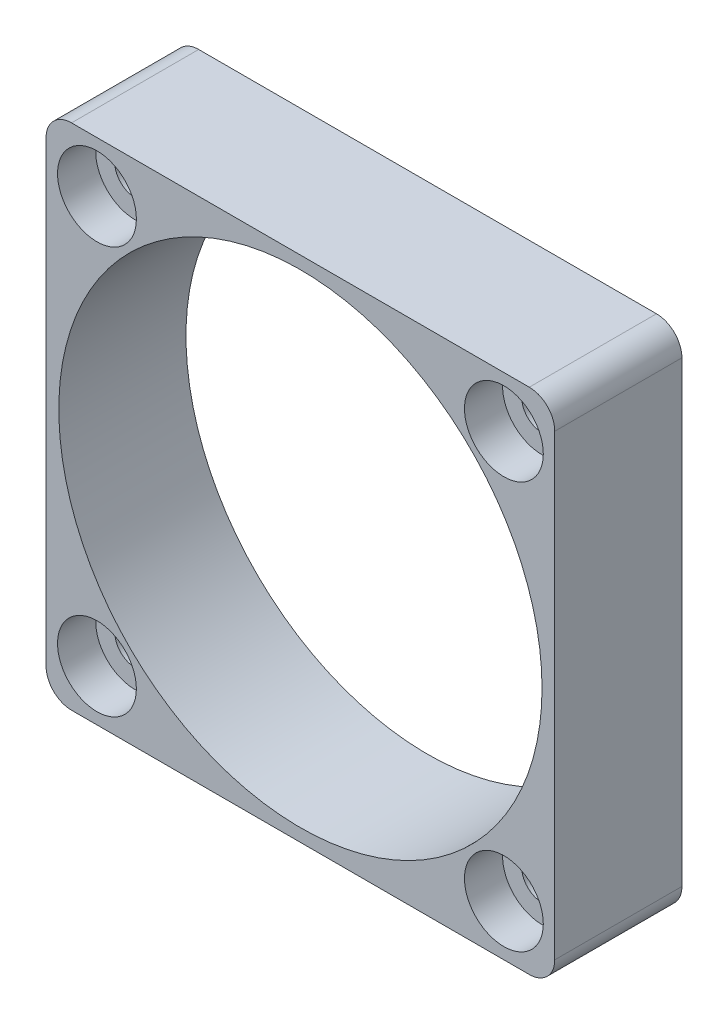
ISO-10303-21;
HEADER;
FILE_DESCRIPTION(('STEP AP214'),'2;1');
FILE_NAME('part.step','',(''),(''),'','','');
FILE_SCHEMA(('AUTOMOTIVE_DESIGN { 1 0 10303 214 1 1 1 1 }'));
ENDSEC;
DATA;
#1=APPLICATION_CONTEXT('core data for automotive mechanical design processes');
#2=APPLICATION_PROTOCOL_DEFINITION('international standard','automotive_design',2000,#1);
#3=PRODUCT_CONTEXT('',#1,'mechanical');
#4=PRODUCT('Part','Part','',(#3));
#5=PRODUCT_RELATED_PRODUCT_CATEGORY('part','',(#4));
#6=PRODUCT_DEFINITION_FORMATION('','',#4);
#7=PRODUCT_DEFINITION_CONTEXT('part definition',#1,'design');
#8=PRODUCT_DEFINITION('design','',#6,#7);
#9=PRODUCT_DEFINITION_SHAPE('','',#8);
#10=(LENGTH_UNIT() NAMED_UNIT(*) SI_UNIT(.MILLI.,.METRE.));
#11=(NAMED_UNIT(*) PLANE_ANGLE_UNIT() SI_UNIT($,.RADIAN.));
#12=(NAMED_UNIT(*) SI_UNIT($,.STERADIAN.) SOLID_ANGLE_UNIT());
#13=UNCERTAINTY_MEASURE_WITH_UNIT(LENGTH_MEASURE(1.E-05),#10,'distance_accuracy_value','');
#14=(GEOMETRIC_REPRESENTATION_CONTEXT(3) GLOBAL_UNCERTAINTY_ASSIGNED_CONTEXT((#13)) GLOBAL_UNIT_ASSIGNED_CONTEXT((#10,
#11,#12)) REPRESENTATION_CONTEXT('',''));
#15=CARTESIAN_POINT('',(0.,0.,0.));
#16=DIRECTION('',(0.,0.,1.));
#17=DIRECTION('',(1.,0.,0.));
#18=AXIS2_PLACEMENT_3D('',#15,#16,#17);
#19=CARTESIAN_POINT('',(-16.,16.,0.));
#20=DIRECTION('',(0.,0.,1.));
#21=DIRECTION('',(1.,0.,0.));
#22=AXIS2_PLACEMENT_3D('',#19,#20,#21);
#23=CYLINDRICAL_SURFACE('',#22,1.6);
#24=CARTESIAN_POINT('',(-16.,16.,0.));
#25=DIRECTION('',(0.,0.,1.));
#26=DIRECTION('',(1.,0.,0.));
#27=AXIS2_PLACEMENT_3D('',#24,#25,#26);
#28=CIRCLE('',#27,1.6);
#29=CARTESIAN_POINT('',(-14.4,16.,0.));
#30=VERTEX_POINT('',#29);
#31=EDGE_CURVE('E199',#30,#30,#28,.T.);
#32=ORIENTED_EDGE('',*,*,#31,.F.);
#33=EDGE_LOOP('',(#32));
#34=FACE_BOUND('',#33,.T.);
#35=CARTESIAN_POINT('',(-16.,16.,7.));
#36=DIRECTION('',(0.,0.,1.));
#37=DIRECTION('',(1.,0.,0.));
#38=AXIS2_PLACEMENT_3D('',#35,#36,#37);
#39=CIRCLE('',#38,1.6);
#40=CARTESIAN_POINT('',(-14.4,16.,7.));
#41=VERTEX_POINT('',#40);
#42=EDGE_CURVE('E37',#41,#41,#39,.F.);
#43=ORIENTED_EDGE('',*,*,#42,.F.);
#44=EDGE_LOOP('',(#43));
#45=FACE_BOUND('',#44,.T.);
#46=ADVANCED_FACE('F33',(#34,#45),#23,.F.);
#47=CARTESIAN_POINT('',(16.,16.,0.));
#48=DIRECTION('',(0.,0.,1.));
#49=DIRECTION('',(1.,0.,0.));
#50=AXIS2_PLACEMENT_3D('',#47,#48,#49);
#51=CYLINDRICAL_SURFACE('',#50,1.6);
#52=CARTESIAN_POINT('',(16.,16.,0.));
#53=DIRECTION('',(0.,0.,1.));
#54=DIRECTION('',(1.,0.,0.));
#55=AXIS2_PLACEMENT_3D('',#52,#53,#54);
#56=CIRCLE('',#55,1.6);
#57=CARTESIAN_POINT('',(17.6,16.,0.));
#58=VERTEX_POINT('',#57);
#59=EDGE_CURVE('E196',#58,#58,#56,.T.);
#60=ORIENTED_EDGE('',*,*,#59,.F.);
#61=EDGE_LOOP('',(#60));
#62=FACE_BOUND('',#61,.T.);
#63=CARTESIAN_POINT('',(16.,16.,7.));
#64=DIRECTION('',(0.,0.,1.));
#65=DIRECTION('',(1.,0.,0.));
#66=AXIS2_PLACEMENT_3D('',#63,#64,#65);
#67=CIRCLE('',#66,1.6);
#68=CARTESIAN_POINT('',(17.6,16.,7.));
#69=VERTEX_POINT('',#68);
#70=EDGE_CURVE('E166',#69,#69,#67,.F.);
#71=ORIENTED_EDGE('',*,*,#70,.F.);
#72=EDGE_LOOP('',(#71));
#73=FACE_BOUND('',#72,.T.);
#74=ADVANCED_FACE('F236',(#62,#73),#51,.F.);
#75=CARTESIAN_POINT('',(16.,-16.,0.));
#76=DIRECTION('',(0.,0.,1.));
#77=DIRECTION('',(1.,0.,0.));
#78=AXIS2_PLACEMENT_3D('',#75,#76,#77);
#79=CYLINDRICAL_SURFACE('',#78,1.6);
#80=CARTESIAN_POINT('',(16.,-16.,0.));
#81=DIRECTION('',(0.,0.,1.));
#82=DIRECTION('',(1.,0.,0.));
#83=AXIS2_PLACEMENT_3D('',#80,#81,#82);
#84=CIRCLE('',#83,1.6);
#85=CARTESIAN_POINT('',(17.6,-16.,0.));
#86=VERTEX_POINT('',#85);
#87=EDGE_CURVE('E193',#86,#86,#84,.T.);
#88=ORIENTED_EDGE('',*,*,#87,.F.);
#89=EDGE_LOOP('',(#88));
#90=FACE_BOUND('',#89,.T.);
#91=CARTESIAN_POINT('',(16.,-16.,7.));
#92=DIRECTION('',(0.,0.,1.));
#93=DIRECTION('',(1.,0.,0.));
#94=AXIS2_PLACEMENT_3D('',#91,#92,#93);
#95=CIRCLE('',#94,1.6);
#96=CARTESIAN_POINT('',(17.6,-16.,7.));
#97=VERTEX_POINT('',#96);
#98=EDGE_CURVE('E162',#97,#97,#95,.F.);
#99=ORIENTED_EDGE('',*,*,#98,.F.);
#100=EDGE_LOOP('',(#99));
#101=FACE_BOUND('',#100,.T.);
#102=ADVANCED_FACE('F242',(#90,#101),#79,.F.);
#103=CARTESIAN_POINT('',(-16.,-16.,0.));
#104=DIRECTION('',(0.,0.,1.));
#105=DIRECTION('',(1.,0.,0.));
#106=AXIS2_PLACEMENT_3D('',#103,#104,#105);
#107=CYLINDRICAL_SURFACE('',#106,1.6);
#108=CARTESIAN_POINT('',(-16.,-16.,0.));
#109=DIRECTION('',(0.,0.,1.));
#110=DIRECTION('',(1.,0.,0.));
#111=AXIS2_PLACEMENT_3D('',#108,#109,#110);
#112=CIRCLE('',#111,1.6);
#113=CARTESIAN_POINT('',(-14.4,-16.,0.));
#114=VERTEX_POINT('',#113);
#115=EDGE_CURVE('E160',#114,#114,#112,.T.);
#116=ORIENTED_EDGE('',*,*,#115,.F.);
#117=EDGE_LOOP('',(#116));
#118=FACE_BOUND('',#117,.T.);
#119=CARTESIAN_POINT('',(-16.,-16.,7.));
#120=DIRECTION('',(0.,0.,1.));
#121=DIRECTION('',(1.,0.,0.));
#122=AXIS2_PLACEMENT_3D('',#119,#120,#121);
#123=CIRCLE('',#122,1.6);
#124=CARTESIAN_POINT('',(-14.4,-16.,7.));
#125=VERTEX_POINT('',#124);
#126=EDGE_CURVE('E157',#125,#125,#123,.F.);
#127=ORIENTED_EDGE('',*,*,#126,.F.);
#128=EDGE_LOOP('',(#127));
#129=FACE_BOUND('',#128,.T.);
#130=ADVANCED_FACE('F275',(#118,#129),#107,.F.);
#131=CARTESIAN_POINT('',(20.,20.,10.));
#132=DIRECTION('',(-1.,0.,0.));
#133=DIRECTION('',(0.,0.,1.));
#134=AXIS2_PLACEMENT_3D('',#131,#132,#133);
#135=PLANE('',#134);
#136=DIRECTION('',(0.,1.,0.));
#137=VECTOR('',#136,1.);
#138=CARTESIAN_POINT('',(20.,20.,10.));
#139=LINE('',#138,#137);
#140=CARTESIAN_POINT('',(20.,-18.,10.));
#141=VERTEX_POINT('',#140);
#142=CARTESIAN_POINT('',(20.,18.,10.));
#143=VERTEX_POINT('',#142);
#144=EDGE_CURVE('E129',#141,#143,#139,.T.);
#145=ORIENTED_EDGE('',*,*,#144,.F.);
#146=DIRECTION('',(0.,0.,-1.));
#147=VECTOR('',#146,1.);
#148=CARTESIAN_POINT('',(20.,-18.,10.));
#149=LINE('',#148,#147);
#150=CARTESIAN_POINT('',(20.,-18.,0.));
#151=VERTEX_POINT('',#150);
#152=EDGE_CURVE('E11',#141,#151,#149,.T.);
#153=ORIENTED_EDGE('',*,*,#152,.T.);
#154=DIRECTION('',(0.,1.,0.));
#155=VECTOR('',#154,1.);
#156=CARTESIAN_POINT('',(20.,20.,0.));
#157=LINE('',#156,#155);
#158=CARTESIAN_POINT('',(20.,18.,0.));
#159=VERTEX_POINT('',#158);
#160=EDGE_CURVE('E206',#151,#159,#157,.T.);
#161=ORIENTED_EDGE('',*,*,#160,.T.);
#162=DIRECTION('',(0.,0.,-1.));
#163=VECTOR('',#162,1.);
#164=CARTESIAN_POINT('',(20.,18.,10.));
#165=LINE('',#164,#163);
#166=EDGE_CURVE('E42',#159,#143,#165,.F.);
#167=ORIENTED_EDGE('',*,*,#166,.T.);
#168=EDGE_LOOP('',(#145,#153,#161,#167));
#169=FACE_BOUND('',#168,.T.);
#170=ADVANCED_FACE('F233',(#169),#135,.F.);
#171=CARTESIAN_POINT('',(-20.,20.,10.));
#172=DIRECTION('',(0.,-1.,0.));
#173=DIRECTION('',(0.,0.,-1.));
#174=AXIS2_PLACEMENT_3D('',#171,#172,#173);
#175=PLANE('',#174);
#176=DIRECTION('',(-1.,0.,0.));
#177=VECTOR('',#176,1.);
#178=CARTESIAN_POINT('',(-20.,20.,0.));
#179=LINE('',#178,#177);
#180=CARTESIAN_POINT('',(18.,20.,0.));
#181=VERTEX_POINT('',#180);
#182=CARTESIAN_POINT('',(-18.,20.,0.));
#183=VERTEX_POINT('',#182);
#184=EDGE_CURVE('E134',#181,#183,#179,.T.);
#185=ORIENTED_EDGE('',*,*,#184,.T.);
#186=DIRECTION('',(0.,0.,-1.));
#187=VECTOR('',#186,1.);
#188=CARTESIAN_POINT('',(-18.,20.,10.));
#189=LINE('',#188,#187);
#190=CARTESIAN_POINT('',(-18.,20.,10.));
#191=VERTEX_POINT('',#190);
#192=EDGE_CURVE('E50',#183,#191,#189,.F.);
#193=ORIENTED_EDGE('',*,*,#192,.T.);
#194=DIRECTION('',(-1.,0.,0.));
#195=VECTOR('',#194,1.);
#196=CARTESIAN_POINT('',(-20.,20.,10.));
#197=LINE('',#196,#195);
#198=CARTESIAN_POINT('',(18.,20.,10.));
#199=VERTEX_POINT('',#198);
#200=EDGE_CURVE('E132',#199,#191,#197,.T.);
#201=ORIENTED_EDGE('',*,*,#200,.F.);
#202=DIRECTION('',(0.,0.,-1.));
#203=VECTOR('',#202,1.);
#204=CARTESIAN_POINT('',(18.,20.,10.));
#205=LINE('',#204,#203);
#206=EDGE_CURVE('E152',#199,#181,#205,.T.);
#207=ORIENTED_EDGE('',*,*,#206,.T.);
#208=EDGE_LOOP('',(#185,#193,#201,#207));
#209=FACE_BOUND('',#208,.T.);
#210=ADVANCED_FACE('F216',(#209),#175,.F.);
#211=CARTESIAN_POINT('',(-20.,20.,10.));
#212=DIRECTION('',(1.,0.,0.));
#213=DIRECTION('',(0.,1.,0.));
#214=AXIS2_PLACEMENT_3D('',#211,#212,#213);
#215=PLANE('',#214);
#216=DIRECTION('',(0.,-1.,0.));
#217=VECTOR('',#216,1.);
#218=CARTESIAN_POINT('',(-20.,20.,0.));
#219=LINE('',#218,#217);
#220=CARTESIAN_POINT('',(-20.,18.,0.));
#221=VERTEX_POINT('',#220);
#222=CARTESIAN_POINT('',(-20.,-18.,0.));
#223=VERTEX_POINT('',#222);
#224=EDGE_CURVE('E130',#221,#223,#219,.T.);
#225=ORIENTED_EDGE('',*,*,#224,.T.);
#226=DIRECTION('',(0.,0.,-1.));
#227=VECTOR('',#226,1.);
#228=CARTESIAN_POINT('',(-20.,-18.,10.));
#229=LINE('',#228,#227);
#230=CARTESIAN_POINT('',(-20.,-18.,10.));
#231=VERTEX_POINT('',#230);
#232=EDGE_CURVE('E107',#223,#231,#229,.F.);
#233=ORIENTED_EDGE('',*,*,#232,.T.);
#234=DIRECTION('',(0.,-1.,0.));
#235=VECTOR('',#234,1.);
#236=CARTESIAN_POINT('',(-20.,20.,10.));
#237=LINE('',#236,#235);
#238=CARTESIAN_POINT('',(-20.,18.,10.));
#239=VERTEX_POINT('',#238);
#240=EDGE_CURVE('E210',#239,#231,#237,.T.);
#241=ORIENTED_EDGE('',*,*,#240,.F.);
#242=DIRECTION('',(0.,0.,-1.));
#243=VECTOR('',#242,1.);
#244=CARTESIAN_POINT('',(-20.,18.,10.));
#245=LINE('',#244,#243);
#246=EDGE_CURVE('E112',#239,#221,#245,.T.);
#247=ORIENTED_EDGE('',*,*,#246,.T.);
#248=EDGE_LOOP('',(#225,#233,#241,#247));
#249=FACE_BOUND('',#248,.T.);
#250=ADVANCED_FACE('F225',(#249),#215,.F.);
#251=CARTESIAN_POINT('',(-20.,-20.,10.));
#252=DIRECTION('',(0.,1.,0.));
#253=DIRECTION('',(0.,0.,1.));
#254=AXIS2_PLACEMENT_3D('',#251,#252,#253);
#255=PLANE('',#254);
#256=DIRECTION('',(1.,0.,0.));
#257=VECTOR('',#256,1.);
#258=CARTESIAN_POINT('',(-20.,-20.,10.));
#259=LINE('',#258,#257);
#260=CARTESIAN_POINT('',(-18.,-20.,10.));
#261=VERTEX_POINT('',#260);
#262=CARTESIAN_POINT('',(18.,-20.,10.));
#263=VERTEX_POINT('',#262);
#264=EDGE_CURVE('E122',#261,#263,#259,.T.);
#265=ORIENTED_EDGE('',*,*,#264,.F.);
#266=DIRECTION('',(0.,0.,-1.));
#267=VECTOR('',#266,1.);
#268=CARTESIAN_POINT('',(-18.,-20.,10.));
#269=LINE('',#268,#267);
#270=CARTESIAN_POINT('',(-18.,-20.,0.));
#271=VERTEX_POINT('',#270);
#272=EDGE_CURVE('E106',#261,#271,#269,.T.);
#273=ORIENTED_EDGE('',*,*,#272,.T.);
#274=DIRECTION('',(1.,0.,0.));
#275=VECTOR('',#274,1.);
#276=CARTESIAN_POINT('',(-20.,-20.,0.));
#277=LINE('',#276,#275);
#278=CARTESIAN_POINT('',(18.,-20.,0.));
#279=VERTEX_POINT('',#278);
#280=EDGE_CURVE('E119',#271,#279,#277,.T.);
#281=ORIENTED_EDGE('',*,*,#280,.T.);
#282=DIRECTION('',(0.,0.,-1.));
#283=VECTOR('',#282,1.);
#284=CARTESIAN_POINT('',(18.,-20.,10.));
#285=LINE('',#284,#283);
#286=EDGE_CURVE('E124',#279,#263,#285,.F.);
#287=ORIENTED_EDGE('',*,*,#286,.T.);
#288=EDGE_LOOP('',(#265,#273,#281,#287));
#289=FACE_BOUND('',#288,.T.);
#290=ADVANCED_FACE('F118',(#289),#255,.F.);
#291=CARTESIAN_POINT('',(0.,0.,10.));
#292=DIRECTION('',(0.,0.,1.));
#293=DIRECTION('',(1.,0.,0.));
#294=AXIS2_PLACEMENT_3D('',#291,#292,#293);
#295=PLANE('',#294);
#296=CARTESIAN_POINT('',(-16.,16.,10.));
#297=DIRECTION('',(0.,0.,1.));
#298=DIRECTION('',(1.,0.,0.));
#299=AXIS2_PLACEMENT_3D('',#296,#297,#298);
#300=CIRCLE('',#299,3.1);
#301=CARTESIAN_POINT('',(-12.9,16.,10.));
#302=VERTEX_POINT('',#301);
#303=EDGE_CURVE('E182',#302,#302,#300,.T.);
#304=ORIENTED_EDGE('',*,*,#303,.F.);
#305=EDGE_LOOP('',(#304));
#306=FACE_BOUND('',#305,.T.);
#307=CARTESIAN_POINT('',(16.,16.,10.));
#308=DIRECTION('',(0.,0.,1.));
#309=DIRECTION('',(1.,0.,0.));
#310=AXIS2_PLACEMENT_3D('',#307,#308,#309);
#311=CIRCLE('',#310,3.1);
#312=CARTESIAN_POINT('',(19.1,16.,10.));
#313=VERTEX_POINT('',#312);
#314=EDGE_CURVE('E175',#313,#313,#311,.T.);
#315=ORIENTED_EDGE('',*,*,#314,.F.);
#316=EDGE_LOOP('',(#315));
#317=FACE_BOUND('',#316,.T.);
#318=CARTESIAN_POINT('',(16.,-16.,10.));
#319=DIRECTION('',(0.,0.,1.));
#320=DIRECTION('',(1.,0.,0.));
#321=AXIS2_PLACEMENT_3D('',#318,#319,#320);
#322=CIRCLE('',#321,3.1);
#323=CARTESIAN_POINT('',(19.1,-16.,10.));
#324=VERTEX_POINT('',#323);
#325=EDGE_CURVE('E168',#324,#324,#322,.T.);
#326=ORIENTED_EDGE('',*,*,#325,.F.);
#327=EDGE_LOOP('',(#326));
#328=FACE_BOUND('',#327,.T.);
#329=CARTESIAN_POINT('',(-16.,-16.,10.));
#330=DIRECTION('',(0.,0.,1.));
#331=DIRECTION('',(1.,0.,0.));
#332=AXIS2_PLACEMENT_3D('',#329,#330,#331);
#333=CIRCLE('',#332,3.1);
#334=CARTESIAN_POINT('',(-12.9,-16.,10.));
#335=VERTEX_POINT('',#334);
#336=EDGE_CURVE('E164',#335,#335,#333,.T.);
#337=ORIENTED_EDGE('',*,*,#336,.F.);
#338=EDGE_LOOP('',(#337));
#339=FACE_BOUND('',#338,.T.);
#340=CARTESIAN_POINT('',(0.,0.,10.));
#341=DIRECTION('',(0.,0.,1.));
#342=DIRECTION('',(1.,0.,0.));
#343=AXIS2_PLACEMENT_3D('',#340,#341,#342);
#344=CIRCLE('',#343,19.);
#345=CARTESIAN_POINT('',(19.,0.,10.));
#346=VERTEX_POINT('',#345);
#347=EDGE_CURVE('E202',#346,#346,#344,.T.);
#348=ORIENTED_EDGE('',*,*,#347,.F.);
#349=EDGE_LOOP('',(#348));
#350=FACE_BOUND('',#349,.T.);
#351=ORIENTED_EDGE('',*,*,#240,.T.);
#352=CARTESIAN_POINT('',(-18.,-18.,10.));
#353=DIRECTION('',(0.,0.,1.));
#354=DIRECTION('',(1.,0.,0.));
#355=AXIS2_PLACEMENT_3D('',#352,#353,#354);
#356=CIRCLE('',#355,2.);
#357=EDGE_CURVE('E150',#231,#261,#356,.T.);
#358=ORIENTED_EDGE('',*,*,#357,.T.);
#359=ORIENTED_EDGE('',*,*,#264,.T.);
#360=CARTESIAN_POINT('',(18.,-18.,10.));
#361=DIRECTION('',(0.,0.,1.));
#362=DIRECTION('',(1.,0.,0.));
#363=AXIS2_PLACEMENT_3D('',#360,#361,#362);
#364=CIRCLE('',#363,2.);
#365=EDGE_CURVE('E146',#263,#141,#364,.T.);
#366=ORIENTED_EDGE('',*,*,#365,.T.);
#367=ORIENTED_EDGE('',*,*,#144,.T.);
#368=CARTESIAN_POINT('',(18.,18.,10.));
#369=DIRECTION('',(0.,0.,1.));
#370=DIRECTION('',(1.,0.,0.));
#371=AXIS2_PLACEMENT_3D('',#368,#369,#370);
#372=CIRCLE('',#371,2.);
#373=EDGE_CURVE('E57',#143,#199,#372,.T.);
#374=ORIENTED_EDGE('',*,*,#373,.T.);
#375=ORIENTED_EDGE('',*,*,#200,.T.);
#376=CARTESIAN_POINT('',(-18.,18.,10.));
#377=DIRECTION('',(0.,0.,1.));
#378=DIRECTION('',(1.,0.,0.));
#379=AXIS2_PLACEMENT_3D('',#376,#377,#378);
#380=CIRCLE('',#379,2.);
#381=EDGE_CURVE('E148',#191,#239,#380,.T.);
#382=ORIENTED_EDGE('',*,*,#381,.T.);
#383=EDGE_LOOP('',(#351,#358,#359,#366,#367,#374,#375,#382));
#384=FACE_BOUND('',#383,.T.);
#385=ADVANCED_FACE('F223',(#306,#317,#328,#339,#350,#384),#295,.T.);
#386=CARTESIAN_POINT('',(0.,0.,0.));
#387=DIRECTION('',(0.,0.,1.));
#388=DIRECTION('',(1.,0.,0.));
#389=AXIS2_PLACEMENT_3D('',#386,#387,#388);
#390=PLANE('',#389);
#391=ORIENTED_EDGE('',*,*,#115,.T.);
#392=EDGE_LOOP('',(#391));
#393=FACE_BOUND('',#392,.T.);
#394=ORIENTED_EDGE('',*,*,#87,.T.);
#395=EDGE_LOOP('',(#394));
#396=FACE_BOUND('',#395,.T.);
#397=ORIENTED_EDGE('',*,*,#59,.T.);
#398=EDGE_LOOP('',(#397));
#399=FACE_BOUND('',#398,.T.);
#400=ORIENTED_EDGE('',*,*,#31,.T.);
#401=EDGE_LOOP('',(#400));
#402=FACE_BOUND('',#401,.T.);
#403=CARTESIAN_POINT('',(0.,0.,0.));
#404=DIRECTION('',(0.,0.,1.));
#405=DIRECTION('',(1.,0.,0.));
#406=AXIS2_PLACEMENT_3D('',#403,#404,#405);
#407=CIRCLE('',#406,19.);
#408=CARTESIAN_POINT('',(19.,0.,0.));
#409=VERTEX_POINT('',#408);
#410=EDGE_CURVE('E203',#409,#409,#407,.T.);
#411=ORIENTED_EDGE('',*,*,#410,.T.);
#412=EDGE_LOOP('',(#411));
#413=FACE_BOUND('',#412,.T.);
#414=ORIENTED_EDGE('',*,*,#280,.F.);
#415=CARTESIAN_POINT('',(-18.,-18.,0.));
#416=DIRECTION('',(0.,0.,1.));
#417=DIRECTION('',(1.,0.,0.));
#418=AXIS2_PLACEMENT_3D('',#415,#416,#417);
#419=CIRCLE('',#418,2.);
#420=EDGE_CURVE('E102',#271,#223,#419,.F.);
#421=ORIENTED_EDGE('',*,*,#420,.T.);
#422=ORIENTED_EDGE('',*,*,#224,.F.);
#423=CARTESIAN_POINT('',(-18.,18.,0.));
#424=DIRECTION('',(0.,0.,1.));
#425=DIRECTION('',(1.,0.,0.));
#426=AXIS2_PLACEMENT_3D('',#423,#424,#425);
#427=CIRCLE('',#426,2.);
#428=EDGE_CURVE('E113',#221,#183,#427,.F.);
#429=ORIENTED_EDGE('',*,*,#428,.T.);
#430=ORIENTED_EDGE('',*,*,#184,.F.);
#431=CARTESIAN_POINT('',(18.,18.,0.));
#432=DIRECTION('',(0.,0.,1.));
#433=DIRECTION('',(1.,0.,0.));
#434=AXIS2_PLACEMENT_3D('',#431,#432,#433);
#435=CIRCLE('',#434,2.);
#436=EDGE_CURVE('E123',#181,#159,#435,.F.);
#437=ORIENTED_EDGE('',*,*,#436,.T.);
#438=ORIENTED_EDGE('',*,*,#160,.F.);
#439=CARTESIAN_POINT('',(18.,-18.,0.));
#440=DIRECTION('',(0.,0.,1.));
#441=DIRECTION('',(1.,0.,0.));
#442=AXIS2_PLACEMENT_3D('',#439,#440,#441);
#443=CIRCLE('',#442,2.);
#444=EDGE_CURVE('E128',#151,#279,#443,.F.);
#445=ORIENTED_EDGE('',*,*,#444,.T.);
#446=EDGE_LOOP('',(#414,#421,#422,#429,#430,#437,#438,#445));
#447=FACE_BOUND('',#446,.T.);
#448=ADVANCED_FACE('F126',(#393,#396,#399,#402,#413,#447),#390,.F.);
#449=CARTESIAN_POINT('',(0.,0.,0.));
#450=DIRECTION('',(0.,0.,1.));
#451=DIRECTION('',(1.,0.,0.));
#452=AXIS2_PLACEMENT_3D('',#449,#450,#451);
#453=CYLINDRICAL_SURFACE('',#452,19.);
#454=ORIENTED_EDGE('',*,*,#410,.F.);
#455=EDGE_LOOP('',(#454));
#456=FACE_BOUND('',#455,.T.);
#457=ORIENTED_EDGE('',*,*,#347,.T.);
#458=EDGE_LOOP('',(#457));
#459=FACE_BOUND('',#458,.T.);
#460=ADVANCED_FACE('F249',(#456,#459),#453,.F.);
#461=CARTESIAN_POINT('',(-18.,-18.,10.));
#462=DIRECTION('',(0.,0.,-1.));
#463=DIRECTION('',(-1.,0.,0.));
#464=AXIS2_PLACEMENT_3D('',#461,#462,#463);
#465=CYLINDRICAL_SURFACE('',#464,2.);
#466=ORIENTED_EDGE('',*,*,#357,.F.);
#467=ORIENTED_EDGE('',*,*,#232,.F.);
#468=ORIENTED_EDGE('',*,*,#420,.F.);
#469=ORIENTED_EDGE('',*,*,#272,.F.);
#470=EDGE_LOOP('',(#466,#467,#468,#469));
#471=FACE_BOUND('',#470,.T.);
#472=ADVANCED_FACE('F105',(#471),#465,.T.);
#473=CARTESIAN_POINT('',(-18.,18.,10.));
#474=DIRECTION('',(0.,0.,-1.));
#475=DIRECTION('',(-1.,0.,0.));
#476=AXIS2_PLACEMENT_3D('',#473,#474,#475);
#477=CYLINDRICAL_SURFACE('',#476,2.);
#478=ORIENTED_EDGE('',*,*,#381,.F.);
#479=ORIENTED_EDGE('',*,*,#192,.F.);
#480=ORIENTED_EDGE('',*,*,#428,.F.);
#481=ORIENTED_EDGE('',*,*,#246,.F.);
#482=EDGE_LOOP('',(#478,#479,#480,#481));
#483=FACE_BOUND('',#482,.T.);
#484=ADVANCED_FACE('F220',(#483),#477,.T.);
#485=CARTESIAN_POINT('',(18.,-18.,10.));
#486=DIRECTION('',(0.,0.,-1.));
#487=DIRECTION('',(-1.,0.,0.));
#488=AXIS2_PLACEMENT_3D('',#485,#486,#487);
#489=CYLINDRICAL_SURFACE('',#488,2.);
#490=ORIENTED_EDGE('',*,*,#365,.F.);
#491=ORIENTED_EDGE('',*,*,#286,.F.);
#492=ORIENTED_EDGE('',*,*,#444,.F.);
#493=ORIENTED_EDGE('',*,*,#152,.F.);
#494=EDGE_LOOP('',(#490,#491,#492,#493));
#495=FACE_BOUND('',#494,.T.);
#496=ADVANCED_FACE('F318',(#495),#489,.T.);
#497=CARTESIAN_POINT('',(18.,18.,10.));
#498=DIRECTION('',(0.,0.,-1.));
#499=DIRECTION('',(-1.,0.,0.));
#500=AXIS2_PLACEMENT_3D('',#497,#498,#499);
#501=CYLINDRICAL_SURFACE('',#500,2.);
#502=ORIENTED_EDGE('',*,*,#373,.F.);
#503=ORIENTED_EDGE('',*,*,#166,.F.);
#504=ORIENTED_EDGE('',*,*,#436,.F.);
#505=ORIENTED_EDGE('',*,*,#206,.F.);
#506=EDGE_LOOP('',(#502,#503,#504,#505));
#507=FACE_BOUND('',#506,.T.);
#508=ADVANCED_FACE('F35',(#507),#501,.T.);
#509=CARTESIAN_POINT('',(-16.,-16.,7.));
#510=DIRECTION('',(0.,0.,1.));
#511=DIRECTION('',(1.,0.,0.));
#512=AXIS2_PLACEMENT_3D('',#509,#510,#511);
#513=PLANE('',#512);
#514=CARTESIAN_POINT('',(-16.,-16.,7.));
#515=DIRECTION('',(0.,0.,1.));
#516=DIRECTION('',(1.,0.,0.));
#517=AXIS2_PLACEMENT_3D('',#514,#515,#516);
#518=CIRCLE('',#517,3.1);
#519=CARTESIAN_POINT('',(-12.9,-16.,7.));
#520=VERTEX_POINT('',#519);
#521=EDGE_CURVE('E161',#520,#520,#518,.T.);
#522=ORIENTED_EDGE('',*,*,#521,.T.);
#523=EDGE_LOOP('',(#522));
#524=FACE_BOUND('',#523,.T.);
#525=ORIENTED_EDGE('',*,*,#126,.T.);
#526=EDGE_LOOP('',(#525));
#527=FACE_BOUND('',#526,.T.);
#528=ADVANCED_FACE('F291',(#524,#527),#513,.T.);
#529=CARTESIAN_POINT('',(-16.,-16.,7.));
#530=DIRECTION('',(0.,0.,1.));
#531=DIRECTION('',(1.,0.,0.));
#532=AXIS2_PLACEMENT_3D('',#529,#530,#531);
#533=CYLINDRICAL_SURFACE('',#532,3.1);
#534=ORIENTED_EDGE('',*,*,#521,.F.);
#535=EDGE_LOOP('',(#534));
#536=FACE_BOUND('',#535,.T.);
#537=ORIENTED_EDGE('',*,*,#336,.T.);
#538=EDGE_LOOP('',(#537));
#539=FACE_BOUND('',#538,.T.);
#540=ADVANCED_FACE('F281',(#536,#539),#533,.F.);
#541=CARTESIAN_POINT('',(16.,-16.,7.));
#542=DIRECTION('',(0.,0.,1.));
#543=DIRECTION('',(1.,0.,0.));
#544=AXIS2_PLACEMENT_3D('',#541,#542,#543);
#545=PLANE('',#544);
#546=CARTESIAN_POINT('',(16.,-16.,7.));
#547=DIRECTION('',(0.,0.,1.));
#548=DIRECTION('',(1.,0.,0.));
#549=AXIS2_PLACEMENT_3D('',#546,#547,#548);
#550=CIRCLE('',#549,3.1);
#551=CARTESIAN_POINT('',(19.1,-16.,7.));
#552=VERTEX_POINT('',#551);
#553=EDGE_CURVE('E165',#552,#552,#550,.T.);
#554=ORIENTED_EDGE('',*,*,#553,.T.);
#555=EDGE_LOOP('',(#554));
#556=FACE_BOUND('',#555,.T.);
#557=ORIENTED_EDGE('',*,*,#98,.T.);
#558=EDGE_LOOP('',(#557));
#559=FACE_BOUND('',#558,.T.);
#560=ADVANCED_FACE('F278',(#556,#559),#545,.T.);
#561=CARTESIAN_POINT('',(16.,-16.,7.));
#562=DIRECTION('',(0.,0.,1.));
#563=DIRECTION('',(1.,0.,0.));
#564=AXIS2_PLACEMENT_3D('',#561,#562,#563);
#565=CYLINDRICAL_SURFACE('',#564,3.1);
#566=ORIENTED_EDGE('',*,*,#553,.F.);
#567=EDGE_LOOP('',(#566));
#568=FACE_BOUND('',#567,.T.);
#569=ORIENTED_EDGE('',*,*,#325,.T.);
#570=EDGE_LOOP('',(#569));
#571=FACE_BOUND('',#570,.T.);
#572=ADVANCED_FACE('F280',(#568,#571),#565,.F.);
#573=CARTESIAN_POINT('',(16.,16.,7.));
#574=DIRECTION('',(0.,0.,1.));
#575=DIRECTION('',(1.,0.,0.));
#576=AXIS2_PLACEMENT_3D('',#573,#574,#575);
#577=PLANE('',#576);
#578=CARTESIAN_POINT('',(16.,16.,7.));
#579=DIRECTION('',(0.,0.,1.));
#580=DIRECTION('',(1.,0.,0.));
#581=AXIS2_PLACEMENT_3D('',#578,#579,#580);
#582=CIRCLE('',#581,3.1);
#583=CARTESIAN_POINT('',(19.1,16.,7.));
#584=VERTEX_POINT('',#583);
#585=EDGE_CURVE('E169',#584,#584,#582,.T.);
#586=ORIENTED_EDGE('',*,*,#585,.T.);
#587=EDGE_LOOP('',(#586));
#588=FACE_BOUND('',#587,.T.);
#589=ORIENTED_EDGE('',*,*,#70,.T.);
#590=EDGE_LOOP('',(#589));
#591=FACE_BOUND('',#590,.T.);
#592=ADVANCED_FACE('F288',(#588,#591),#577,.T.);
#593=CARTESIAN_POINT('',(16.,16.,7.));
#594=DIRECTION('',(0.,0.,1.));
#595=DIRECTION('',(1.,0.,0.));
#596=AXIS2_PLACEMENT_3D('',#593,#594,#595);
#597=CYLINDRICAL_SURFACE('',#596,3.1);
#598=ORIENTED_EDGE('',*,*,#585,.F.);
#599=EDGE_LOOP('',(#598));
#600=FACE_BOUND('',#599,.T.);
#601=ORIENTED_EDGE('',*,*,#314,.T.);
#602=EDGE_LOOP('',(#601));
#603=FACE_BOUND('',#602,.T.);
#604=ADVANCED_FACE('F295',(#600,#603),#597,.F.);
#605=CARTESIAN_POINT('',(-16.,16.,7.));
#606=DIRECTION('',(0.,0.,1.));
#607=DIRECTION('',(1.,0.,0.));
#608=AXIS2_PLACEMENT_3D('',#605,#606,#607);
#609=PLANE('',#608);
#610=CARTESIAN_POINT('',(-16.,16.,7.));
#611=DIRECTION('',(0.,0.,1.));
#612=DIRECTION('',(1.,0.,0.));
#613=AXIS2_PLACEMENT_3D('',#610,#611,#612);
#614=CIRCLE('',#613,3.1);
#615=CARTESIAN_POINT('',(-12.9,16.,7.));
#616=VERTEX_POINT('',#615);
#617=EDGE_CURVE('E391',#616,#616,#614,.T.);
#618=ORIENTED_EDGE('',*,*,#617,.T.);
#619=EDGE_LOOP('',(#618));
#620=FACE_BOUND('',#619,.T.);
#621=ORIENTED_EDGE('',*,*,#42,.T.);
#622=EDGE_LOOP('',(#621));
#623=FACE_BOUND('',#622,.T.);
#624=ADVANCED_FACE('F365',(#620,#623),#609,.T.);
#625=CARTESIAN_POINT('',(-16.,16.,7.));
#626=DIRECTION('',(0.,0.,1.));
#627=DIRECTION('',(1.,0.,0.));
#628=AXIS2_PLACEMENT_3D('',#625,#626,#627);
#629=CYLINDRICAL_SURFACE('',#628,3.1);
#630=ORIENTED_EDGE('',*,*,#617,.F.);
#631=EDGE_LOOP('',(#630));
#632=FACE_BOUND('',#631,.T.);
#633=ORIENTED_EDGE('',*,*,#303,.T.);
#634=EDGE_LOOP('',(#633));
#635=FACE_BOUND('',#634,.T.);
#636=ADVANCED_FACE('F374',(#632,#635),#629,.F.);
#637=CLOSED_SHELL('',(#46,#74,#102,#130,#170,#210,#250,#290,#385,#448,#460,#472,#484,#496,#508,
#528,#540,#560,#572,#592,#604,#624,#636));
#638=MANIFOLD_SOLID_BREP('B2',#637);
#639=ADVANCED_BREP_SHAPE_REPRESENTATION('',(#18,#638),#14);
#640=SHAPE_DEFINITION_REPRESENTATION(#9,#639);
ENDSEC;
END-ISO-10303-21;
